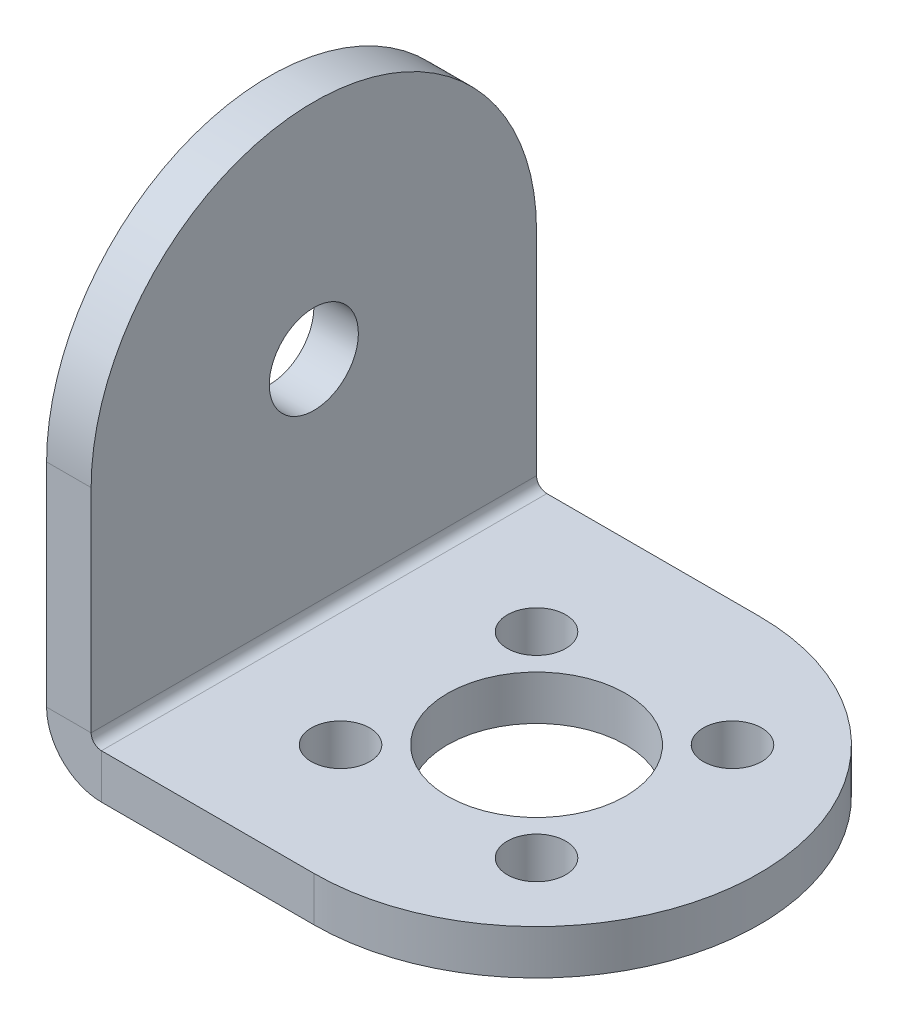
ISO-10303-21;
HEADER;
FILE_DESCRIPTION(('STEP AP214'),'2;1');
FILE_NAME('part.step','',(''),(''),'','','');
FILE_SCHEMA(('AUTOMOTIVE_DESIGN { 1 0 10303 214 1 1 1 1 }'));
ENDSEC;
DATA;
#1=APPLICATION_CONTEXT('core data for automotive mechanical design processes');
#2=APPLICATION_PROTOCOL_DEFINITION('international standard','automotive_design',2000,#1);
#3=PRODUCT_CONTEXT('',#1,'mechanical');
#4=PRODUCT('Part','Part','',(#3));
#5=PRODUCT_RELATED_PRODUCT_CATEGORY('part','',(#4));
#6=PRODUCT_DEFINITION_FORMATION('','',#4);
#7=PRODUCT_DEFINITION_CONTEXT('part definition',#1,'design');
#8=PRODUCT_DEFINITION('design','',#6,#7);
#9=PRODUCT_DEFINITION_SHAPE('','',#8);
#10=(LENGTH_UNIT() NAMED_UNIT(*) SI_UNIT(.MILLI.,.METRE.));
#11=(NAMED_UNIT(*) PLANE_ANGLE_UNIT() SI_UNIT($,.RADIAN.));
#12=(NAMED_UNIT(*) SI_UNIT($,.STERADIAN.) SOLID_ANGLE_UNIT());
#13=UNCERTAINTY_MEASURE_WITH_UNIT(LENGTH_MEASURE(1.E-05),#10,'distance_accuracy_value','');
#14=(GEOMETRIC_REPRESENTATION_CONTEXT(3) GLOBAL_UNCERTAINTY_ASSIGNED_CONTEXT((#13)) GLOBAL_UNIT_ASSIGNED_CONTEXT((#10,
#11,#12)) REPRESENTATION_CONTEXT('',''));
#15=CARTESIAN_POINT('',(0.,0.,0.));
#16=DIRECTION('',(0.,0.,1.));
#17=DIRECTION('',(1.,0.,0.));
#18=AXIS2_PLACEMENT_3D('',#15,#16,#17);
#19=CARTESIAN_POINT('',(15.875,0.,0.));
#20=DIRECTION('',(0.,-1.,0.));
#21=DIRECTION('',(0.,0.,-1.));
#22=AXIS2_PLACEMENT_3D('',#19,#20,#21);
#23=CYLINDRICAL_SURFACE('',#22,15.875);
#24=DIRECTION('',(0.,-1.,0.));
#25=VECTOR('',#24,1.);
#26=CARTESIAN_POINT('',(15.875,0.7366,-15.875));
#27=LINE('',#26,#25);
#28=CARTESIAN_POINT('',(15.875,0.,-15.875));
#29=VERTEX_POINT('',#28);
#30=CARTESIAN_POINT('',(15.875,-3.175,-15.875));
#31=VERTEX_POINT('',#30);
#32=EDGE_CURVE('E184',#29,#31,#27,.T.);
#33=ORIENTED_EDGE('',*,*,#32,.F.);
#34=CARTESIAN_POINT('',(15.875,0.,0.));
#35=DIRECTION('',(0.,1.,0.));
#36=DIRECTION('',(0.,0.,1.));
#37=AXIS2_PLACEMENT_3D('',#34,#35,#36);
#38=CIRCLE('',#37,15.875);
#39=CARTESIAN_POINT('',(15.875,0.,15.875));
#40=VERTEX_POINT('',#39);
#41=EDGE_CURVE('E49',#40,#29,#38,.T.);
#42=ORIENTED_EDGE('',*,*,#41,.F.);
#43=DIRECTION('',(0.,-1.,0.));
#44=VECTOR('',#43,1.);
#45=CARTESIAN_POINT('',(15.875,0.736600000000001,15.875));
#46=LINE('',#45,#44);
#47=CARTESIAN_POINT('',(15.875,-3.175,15.875));
#48=VERTEX_POINT('',#47);
#49=EDGE_CURVE('E135',#48,#40,#46,.F.);
#50=ORIENTED_EDGE('',*,*,#49,.F.);
#51=CARTESIAN_POINT('',(15.875,-3.175,0.));
#52=DIRECTION('',(0.,1.,0.));
#53=DIRECTION('',(0.,0.,1.));
#54=AXIS2_PLACEMENT_3D('',#51,#52,#53);
#55=CIRCLE('',#54,15.875);
#56=EDGE_CURVE('E11',#31,#48,#55,.F.);
#57=ORIENTED_EDGE('',*,*,#56,.F.);
#58=EDGE_LOOP('',(#33,#42,#50,#57));
#59=FACE_BOUND('',#58,.T.);
#60=ADVANCED_FACE('F41',(#59),#23,.T.);
#61=CARTESIAN_POINT('',(0.,15.875,0.));
#62=DIRECTION('',(1.,0.,0.));
#63=DIRECTION('',(0.,0.,-1.));
#64=AXIS2_PLACEMENT_3D('',#61,#62,#63);
#65=CYLINDRICAL_SURFACE('',#64,15.875);
#66=DIRECTION('',(-1.,0.,0.));
#67=VECTOR('',#66,1.);
#68=CARTESIAN_POINT('',(0.,15.875,15.875));
#69=LINE('',#68,#67);
#70=CARTESIAN_POINT('',(0.,15.875,15.875));
#71=VERTEX_POINT('',#70);
#72=CARTESIAN_POINT('',(-3.175,15.875,15.875));
#73=VERTEX_POINT('',#72);
#74=EDGE_CURVE('E116',#71,#73,#69,.T.);
#75=ORIENTED_EDGE('',*,*,#74,.F.);
#76=CARTESIAN_POINT('',(0.,15.875,0.));
#77=DIRECTION('',(1.,0.,0.));
#78=DIRECTION('',(0.,1.,0.));
#79=AXIS2_PLACEMENT_3D('',#76,#77,#78);
#80=CIRCLE('',#79,15.875);
#81=CARTESIAN_POINT('',(0.,15.875,-15.875));
#82=VERTEX_POINT('',#81);
#83=EDGE_CURVE('E180',#82,#71,#80,.T.);
#84=ORIENTED_EDGE('',*,*,#83,.F.);
#85=DIRECTION('',(1.,0.,0.));
#86=VECTOR('',#85,1.);
#87=CARTESIAN_POINT('',(0.7366,15.875,-15.875));
#88=LINE('',#87,#86);
#89=CARTESIAN_POINT('',(-3.175,15.875,-15.875));
#90=VERTEX_POINT('',#89);
#91=EDGE_CURVE('E177',#90,#82,#88,.T.);
#92=ORIENTED_EDGE('',*,*,#91,.F.);
#93=CARTESIAN_POINT('',(-3.175,15.875,0.));
#94=DIRECTION('',(1.,0.,0.));
#95=DIRECTION('',(0.,1.,0.));
#96=AXIS2_PLACEMENT_3D('',#93,#94,#95);
#97=CIRCLE('',#96,15.875);
#98=EDGE_CURVE('E182',#73,#90,#97,.F.);
#99=ORIENTED_EDGE('',*,*,#98,.F.);
#100=EDGE_LOOP('',(#75,#84,#92,#99));
#101=FACE_BOUND('',#100,.T.);
#102=ADVANCED_FACE('F272',(#101),#65,.T.);
#103=CARTESIAN_POINT('',(0.7366,0.,15.875));
#104=DIRECTION('',(0.,0.,1.));
#105=DIRECTION('',(1.,0.,0.));
#106=AXIS2_PLACEMENT_3D('',#103,#104,#105);
#107=PLANE('',#106);
#108=DIRECTION('',(0.,-1.,0.));
#109=VECTOR('',#108,1.);
#110=CARTESIAN_POINT('',(0.7366,0.,15.875));
#111=LINE('',#110,#109);
#112=CARTESIAN_POINT('',(0.7366,0.,15.875));
#113=VERTEX_POINT('',#112);
#114=CARTESIAN_POINT('',(0.7366,-3.175,15.875));
#115=VERTEX_POINT('',#114);
#116=EDGE_CURVE('E104',#113,#115,#111,.T.);
#117=ORIENTED_EDGE('',*,*,#116,.F.);
#118=CARTESIAN_POINT('',(0.7366,0.7366,15.875));
#119=DIRECTION('',(0.,0.,-1.));
#120=DIRECTION('',(-1.,0.,0.));
#121=AXIS2_PLACEMENT_3D('',#118,#119,#120);
#122=CIRCLE('',#121,0.7366);
#123=CARTESIAN_POINT('',(0.,0.7366,15.875));
#124=VERTEX_POINT('',#123);
#125=EDGE_CURVE('E109',#124,#113,#122,.F.);
#126=ORIENTED_EDGE('',*,*,#125,.F.);
#127=DIRECTION('',(1.,0.,0.));
#128=VECTOR('',#127,1.);
#129=CARTESIAN_POINT('',(-3.175,0.736600000000001,15.875));
#130=LINE('',#129,#128);
#131=CARTESIAN_POINT('',(-3.175,0.736600000000001,15.875));
#132=VERTEX_POINT('',#131);
#133=EDGE_CURVE('E117',#132,#124,#130,.T.);
#134=ORIENTED_EDGE('',*,*,#133,.F.);
#135=CARTESIAN_POINT('',(0.7366,0.7366,15.875));
#136=DIRECTION('',(0.,0.,1.));
#137=DIRECTION('',(1.,0.,0.));
#138=AXIS2_PLACEMENT_3D('',#135,#136,#137);
#139=CIRCLE('',#138,3.9116);
#140=EDGE_CURVE('E111',#132,#115,#139,.T.);
#141=ORIENTED_EDGE('',*,*,#140,.T.);
#142=EDGE_LOOP('',(#117,#126,#134,#141));
#143=FACE_BOUND('',#142,.T.);
#144=ADVANCED_FACE('F106',(#143),#107,.T.);
#145=CARTESIAN_POINT('',(-3.175,0.736600000000001,15.875));
#146=DIRECTION('',(0.,0.,1.));
#147=DIRECTION('',(1.,0.,0.));
#148=AXIS2_PLACEMENT_3D('',#145,#146,#147);
#149=PLANE('',#148);
#150=DIRECTION('',(1.,0.,0.));
#151=VECTOR('',#150,1.);
#152=CARTESIAN_POINT('',(0.,-3.175,15.875));
#153=LINE('',#152,#151);
#154=EDGE_CURVE('E136',#115,#48,#153,.T.);
#155=ORIENTED_EDGE('',*,*,#154,.T.);
#156=ORIENTED_EDGE('',*,*,#49,.T.);
#157=DIRECTION('',(1.,0.,0.));
#158=VECTOR('',#157,1.);
#159=CARTESIAN_POINT('',(0.,0.,15.875));
#160=LINE('',#159,#158);
#161=EDGE_CURVE('E125',#113,#40,#160,.T.);
#162=ORIENTED_EDGE('',*,*,#161,.F.);
#163=ORIENTED_EDGE('',*,*,#116,.T.);
#164=EDGE_LOOP('',(#155,#156,#162,#163));
#165=FACE_BOUND('',#164,.T.);
#166=ADVANCED_FACE('F134',(#165),#149,.T.);
#167=CARTESIAN_POINT('',(0.,0.7366,-15.875));
#168=DIRECTION('',(0.,0.,-1.));
#169=DIRECTION('',(-1.,0.,0.));
#170=AXIS2_PLACEMENT_3D('',#167,#168,#169);
#171=PLANE('',#170);
#172=DIRECTION('',(-1.,0.,0.));
#173=VECTOR('',#172,1.);
#174=CARTESIAN_POINT('',(0.,0.7366,-15.875));
#175=LINE('',#174,#173);
#176=CARTESIAN_POINT('',(0.,0.7366,-15.875));
#177=VERTEX_POINT('',#176);
#178=CARTESIAN_POINT('',(-3.175,0.736600000000001,-15.875));
#179=VERTEX_POINT('',#178);
#180=EDGE_CURVE('E170',#177,#179,#175,.T.);
#181=ORIENTED_EDGE('',*,*,#180,.F.);
#182=CARTESIAN_POINT('',(0.7366,0.7366,-15.875));
#183=DIRECTION('',(0.,0.,-1.));
#184=DIRECTION('',(-1.,0.,0.));
#185=AXIS2_PLACEMENT_3D('',#182,#183,#184);
#186=CIRCLE('',#185,0.7366);
#187=CARTESIAN_POINT('',(0.7366,0.,-15.875));
#188=VERTEX_POINT('',#187);
#189=EDGE_CURVE('E154',#177,#188,#186,.F.);
#190=ORIENTED_EDGE('',*,*,#189,.T.);
#191=DIRECTION('',(0.,1.,0.));
#192=VECTOR('',#191,1.);
#193=CARTESIAN_POINT('',(0.7366,-3.175,-15.875));
#194=LINE('',#193,#192);
#195=CARTESIAN_POINT('',(0.7366,-3.175,-15.875));
#196=VERTEX_POINT('',#195);
#197=EDGE_CURVE('E131',#196,#188,#194,.T.);
#198=ORIENTED_EDGE('',*,*,#197,.F.);
#199=CARTESIAN_POINT('',(0.7366,0.7366,-15.875));
#200=DIRECTION('',(0.,0.,1.));
#201=DIRECTION('',(1.,0.,0.));
#202=AXIS2_PLACEMENT_3D('',#199,#200,#201);
#203=CIRCLE('',#202,3.9116);
#204=EDGE_CURVE('E160',#179,#196,#203,.T.);
#205=ORIENTED_EDGE('',*,*,#204,.F.);
#206=EDGE_LOOP('',(#181,#190,#198,#205));
#207=FACE_BOUND('',#206,.T.);
#208=ADVANCED_FACE('F193',(#207),#171,.T.);
#209=CARTESIAN_POINT('',(0.7366,-3.175,-15.875));
#210=DIRECTION('',(0.,0.,-1.));
#211=DIRECTION('',(-1.,0.,0.));
#212=AXIS2_PLACEMENT_3D('',#209,#210,#211);
#213=PLANE('',#212);
#214=DIRECTION('',(0.,-1.,0.));
#215=VECTOR('',#214,1.);
#216=CARTESIAN_POINT('',(-3.175,31.75,-15.875));
#217=LINE('',#216,#215);
#218=EDGE_CURVE('E158',#90,#179,#217,.T.);
#219=ORIENTED_EDGE('',*,*,#218,.F.);
#220=ORIENTED_EDGE('',*,*,#91,.T.);
#221=DIRECTION('',(0.,-1.,0.));
#222=VECTOR('',#221,1.);
#223=CARTESIAN_POINT('',(0.,31.75,-15.875));
#224=LINE('',#223,#222);
#225=EDGE_CURVE('E156',#82,#177,#224,.T.);
#226=ORIENTED_EDGE('',*,*,#225,.T.);
#227=ORIENTED_EDGE('',*,*,#180,.T.);
#228=EDGE_LOOP('',(#219,#220,#226,#227));
#229=FACE_BOUND('',#228,.T.);
#230=ADVANCED_FACE('F290',(#229),#213,.T.);
#231=CARTESIAN_POINT('',(0.,-3.175,15.875));
#232=DIRECTION('',(0.,1.,0.));
#233=DIRECTION('',(0.,0.,1.));
#234=AXIS2_PLACEMENT_3D('',#231,#232,#233);
#235=PLANE('',#234);
#236=CARTESIAN_POINT('',(22.8600000000022,-3.175,-6.98499999999986));
#237=DIRECTION('',(0.,1.,0.));
#238=DIRECTION('',(0.,0.,1.));
#239=AXIS2_PLACEMENT_3D('',#236,#237,#238);
#240=CIRCLE('',#239,2.08279999999637);
#241=CARTESIAN_POINT('',(22.8600000000022,-3.175,-4.90220000000349));
#242=VERTEX_POINT('',#241);
#243=EDGE_CURVE('E214',#242,#242,#240,.T.);
#244=ORIENTED_EDGE('',*,*,#243,.T.);
#245=EDGE_LOOP('',(#244));
#246=FACE_BOUND('',#245,.T.);
#247=CARTESIAN_POINT('',(8.89000000000219,-3.175,-6.98499999999986));
#248=DIRECTION('',(0.,1.,0.));
#249=DIRECTION('',(0.,0.,1.));
#250=AXIS2_PLACEMENT_3D('',#247,#248,#249);
#251=CIRCLE('',#250,2.08279999991159);
#252=CARTESIAN_POINT('',(8.89000000000219,-3.175,-4.90220000008827));
#253=VERTEX_POINT('',#252);
#254=EDGE_CURVE('E226',#253,#253,#251,.T.);
#255=ORIENTED_EDGE('',*,*,#254,.T.);
#256=EDGE_LOOP('',(#255));
#257=FACE_BOUND('',#256,.T.);
#258=CARTESIAN_POINT('',(8.89000000000219,-3.175,6.98500000000015));
#259=DIRECTION('',(0.,1.,0.));
#260=DIRECTION('',(0.,0.,1.));
#261=AXIS2_PLACEMENT_3D('',#258,#259,#260);
#262=CIRCLE('',#261,2.08279999991158);
#263=CARTESIAN_POINT('',(8.89000000000219,-3.175,9.06779999991173));
#264=VERTEX_POINT('',#263);
#265=EDGE_CURVE('E220',#264,#264,#262,.T.);
#266=ORIENTED_EDGE('',*,*,#265,.T.);
#267=EDGE_LOOP('',(#266));
#268=FACE_BOUND('',#267,.T.);
#269=CARTESIAN_POINT('',(22.8600000000022,-3.175,6.98500000000014));
#270=DIRECTION('',(0.,1.,0.));
#271=DIRECTION('',(0.,0.,1.));
#272=AXIS2_PLACEMENT_3D('',#269,#270,#271);
#273=CIRCLE('',#272,2.08279999999637);
#274=CARTESIAN_POINT('',(22.8600000000022,-3.175,9.06779999999651));
#275=VERTEX_POINT('',#274);
#276=EDGE_CURVE('E208',#275,#275,#273,.T.);
#277=ORIENTED_EDGE('',*,*,#276,.T.);
#278=EDGE_LOOP('',(#277));
#279=FACE_BOUND('',#278,.T.);
#280=CARTESIAN_POINT('',(15.875,-3.175,0.));
#281=DIRECTION('',(0.,1.,0.));
#282=DIRECTION('',(0.,0.,1.));
#283=AXIS2_PLACEMENT_3D('',#280,#281,#282);
#284=CIRCLE('',#283,6.35);
#285=CARTESIAN_POINT('',(15.875,-3.175,6.35));
#286=VERTEX_POINT('',#285);
#287=EDGE_CURVE('E202',#286,#286,#284,.T.);
#288=ORIENTED_EDGE('',*,*,#287,.T.);
#289=EDGE_LOOP('',(#288));
#290=FACE_BOUND('',#289,.T.);
#291=DIRECTION('',(1.,0.,0.));
#292=VECTOR('',#291,1.);
#293=CARTESIAN_POINT('',(0.,-3.175,-15.875));
#294=LINE('',#293,#292);
#295=EDGE_CURVE('E150',#196,#31,#294,.T.);
#296=ORIENTED_EDGE('',*,*,#295,.T.);
#297=ORIENTED_EDGE('',*,*,#56,.T.);
#298=ORIENTED_EDGE('',*,*,#154,.F.);
#299=DIRECTION('',(0.,0.,-1.));
#300=VECTOR('',#299,1.);
#301=CARTESIAN_POINT('',(0.7366,-3.175,15.875));
#302=LINE('',#301,#300);
#303=EDGE_CURVE('E149',#115,#196,#302,.T.);
#304=ORIENTED_EDGE('',*,*,#303,.T.);
#305=EDGE_LOOP('',(#296,#297,#298,#304));
#306=FACE_BOUND('',#305,.T.);
#307=ADVANCED_FACE('F197',(#246,#257,#268,#279,#290,#306),#235,.F.);
#308=CARTESIAN_POINT('',(0.,0.,15.875));
#309=DIRECTION('',(0.,1.,0.));
#310=DIRECTION('',(0.,0.,1.));
#311=AXIS2_PLACEMENT_3D('',#308,#309,#310);
#312=PLANE('',#311);
#313=CARTESIAN_POINT('',(22.8600000000022,0.,-6.98499999999986));
#314=DIRECTION('',(0.,1.,0.));
#315=DIRECTION('',(0.,0.,1.));
#316=AXIS2_PLACEMENT_3D('',#313,#314,#315);
#317=CIRCLE('',#316,2.08279999999637);
#318=CARTESIAN_POINT('',(22.8600000000022,0.,-4.90220000000349));
#319=VERTEX_POINT('',#318);
#320=EDGE_CURVE('E229',#319,#319,#317,.T.);
#321=ORIENTED_EDGE('',*,*,#320,.F.);
#322=EDGE_LOOP('',(#321));
#323=FACE_BOUND('',#322,.T.);
#324=CARTESIAN_POINT('',(8.89000000000219,0.,-6.98499999999986));
#325=DIRECTION('',(0.,1.,0.));
#326=DIRECTION('',(0.,0.,1.));
#327=AXIS2_PLACEMENT_3D('',#324,#325,#326);
#328=CIRCLE('',#327,2.08279999991159);
#329=CARTESIAN_POINT('',(8.89000000000219,0.,-4.90220000008827));
#330=VERTEX_POINT('',#329);
#331=EDGE_CURVE('E223',#330,#330,#328,.T.);
#332=ORIENTED_EDGE('',*,*,#331,.F.);
#333=EDGE_LOOP('',(#332));
#334=FACE_BOUND('',#333,.T.);
#335=CARTESIAN_POINT('',(8.89000000000219,0.,6.98500000000015));
#336=DIRECTION('',(0.,1.,0.));
#337=DIRECTION('',(0.,0.,1.));
#338=AXIS2_PLACEMENT_3D('',#335,#336,#337);
#339=CIRCLE('',#338,2.08279999991158);
#340=CARTESIAN_POINT('',(8.89000000000219,0.,9.06779999991173));
#341=VERTEX_POINT('',#340);
#342=EDGE_CURVE('E217',#341,#341,#339,.T.);
#343=ORIENTED_EDGE('',*,*,#342,.F.);
#344=EDGE_LOOP('',(#343));
#345=FACE_BOUND('',#344,.T.);
#346=CARTESIAN_POINT('',(22.8600000000022,0.,6.98500000000014));
#347=DIRECTION('',(0.,1.,0.));
#348=DIRECTION('',(0.,0.,1.));
#349=AXIS2_PLACEMENT_3D('',#346,#347,#348);
#350=CIRCLE('',#349,2.08279999999637);
#351=CARTESIAN_POINT('',(22.8600000000022,0.,9.06779999999651));
#352=VERTEX_POINT('',#351);
#353=EDGE_CURVE('E211',#352,#352,#350,.T.);
#354=ORIENTED_EDGE('',*,*,#353,.F.);
#355=EDGE_LOOP('',(#354));
#356=FACE_BOUND('',#355,.T.);
#357=CARTESIAN_POINT('',(15.875,0.,0.));
#358=DIRECTION('',(0.,1.,0.));
#359=DIRECTION('',(0.,0.,1.));
#360=AXIS2_PLACEMENT_3D('',#357,#358,#359);
#361=CIRCLE('',#360,6.35);
#362=CARTESIAN_POINT('',(15.875,0.,6.35));
#363=VERTEX_POINT('',#362);
#364=EDGE_CURVE('E205',#363,#363,#361,.T.);
#365=ORIENTED_EDGE('',*,*,#364,.F.);
#366=EDGE_LOOP('',(#365));
#367=FACE_BOUND('',#366,.T.);
#368=ORIENTED_EDGE('',*,*,#161,.T.);
#369=ORIENTED_EDGE('',*,*,#41,.T.);
#370=DIRECTION('',(1.,0.,0.));
#371=VECTOR('',#370,1.);
#372=CARTESIAN_POINT('',(0.,0.,-15.875));
#373=LINE('',#372,#371);
#374=EDGE_CURVE('E127',#188,#29,#373,.T.);
#375=ORIENTED_EDGE('',*,*,#374,.F.);
#376=DIRECTION('',(0.,0.,-1.));
#377=VECTOR('',#376,1.);
#378=CARTESIAN_POINT('',(0.7366,0.,15.875));
#379=LINE('',#378,#377);
#380=EDGE_CURVE('E123',#113,#188,#379,.T.);
#381=ORIENTED_EDGE('',*,*,#380,.F.);
#382=EDGE_LOOP('',(#368,#369,#375,#381));
#383=FACE_BOUND('',#382,.T.);
#384=ADVANCED_FACE('F124',(#323,#334,#345,#356,#367,#383),#312,.T.);
#385=CARTESIAN_POINT('',(0.7366,0.7366,15.875));
#386=DIRECTION('',(0.,0.,-1.));
#387=DIRECTION('',(-1.,0.,0.));
#388=AXIS2_PLACEMENT_3D('',#385,#386,#387);
#389=CYLINDRICAL_SURFACE('',#388,0.7366);
#390=ORIENTED_EDGE('',*,*,#189,.F.);
#391=DIRECTION('',(0.,0.,-1.));
#392=VECTOR('',#391,1.);
#393=CARTESIAN_POINT('',(0.,0.7366,15.875));
#394=LINE('',#393,#392);
#395=EDGE_CURVE('E132',#124,#177,#394,.T.);
#396=ORIENTED_EDGE('',*,*,#395,.F.);
#397=ORIENTED_EDGE('',*,*,#125,.T.);
#398=ORIENTED_EDGE('',*,*,#380,.T.);
#399=EDGE_LOOP('',(#390,#396,#397,#398));
#400=FACE_BOUND('',#399,.T.);
#401=ADVANCED_FACE('F139',(#400),#389,.F.);
#402=CARTESIAN_POINT('',(0.,31.75,15.875));
#403=DIRECTION('',(1.,0.,0.));
#404=DIRECTION('',(0.,1.,0.));
#405=AXIS2_PLACEMENT_3D('',#402,#403,#404);
#406=PLANE('',#405);
#407=CARTESIAN_POINT('',(0.,15.875,0.));
#408=DIRECTION('',(1.,0.,0.));
#409=DIRECTION('',(0.,1.,0.));
#410=AXIS2_PLACEMENT_3D('',#407,#408,#409);
#411=CIRCLE('',#410,3.175);
#412=CARTESIAN_POINT('',(0.,19.05,0.));
#413=VERTEX_POINT('',#412);
#414=EDGE_CURVE('E199',#413,#413,#411,.T.);
#415=ORIENTED_EDGE('',*,*,#414,.F.);
#416=EDGE_LOOP('',(#415));
#417=FACE_BOUND('',#416,.T.);
#418=ORIENTED_EDGE('',*,*,#225,.F.);
#419=ORIENTED_EDGE('',*,*,#83,.T.);
#420=DIRECTION('',(0.,-1.,0.));
#421=VECTOR('',#420,1.);
#422=CARTESIAN_POINT('',(0.,31.75,15.875));
#423=LINE('',#422,#421);
#424=EDGE_CURVE('E141',#71,#124,#423,.T.);
#425=ORIENTED_EDGE('',*,*,#424,.T.);
#426=ORIENTED_EDGE('',*,*,#395,.T.);
#427=EDGE_LOOP('',(#418,#419,#425,#426));
#428=FACE_BOUND('',#427,.T.);
#429=ADVANCED_FACE('F298',(#417,#428),#406,.T.);
#430=CARTESIAN_POINT('',(-3.175,31.75,15.875));
#431=DIRECTION('',(1.,0.,0.));
#432=DIRECTION('',(0.,1.,0.));
#433=AXIS2_PLACEMENT_3D('',#430,#431,#432);
#434=PLANE('',#433);
#435=CARTESIAN_POINT('',(-3.175,15.875,0.));
#436=DIRECTION('',(1.,0.,0.));
#437=DIRECTION('',(0.,1.,0.));
#438=AXIS2_PLACEMENT_3D('',#435,#436,#437);
#439=CIRCLE('',#438,3.175);
#440=CARTESIAN_POINT('',(-3.175,19.05,0.));
#441=VERTEX_POINT('',#440);
#442=EDGE_CURVE('E152',#441,#441,#439,.T.);
#443=ORIENTED_EDGE('',*,*,#442,.T.);
#444=EDGE_LOOP('',(#443));
#445=FACE_BOUND('',#444,.T.);
#446=DIRECTION('',(0.,-1.,0.));
#447=VECTOR('',#446,1.);
#448=CARTESIAN_POINT('',(-3.175,31.75,15.875));
#449=LINE('',#448,#447);
#450=EDGE_CURVE('E143',#73,#132,#449,.T.);
#451=ORIENTED_EDGE('',*,*,#450,.F.);
#452=ORIENTED_EDGE('',*,*,#98,.T.);
#453=ORIENTED_EDGE('',*,*,#218,.T.);
#454=DIRECTION('',(0.,0.,-1.));
#455=VECTOR('',#454,1.);
#456=CARTESIAN_POINT('',(-3.175,0.736600000000001,15.875));
#457=LINE('',#456,#455);
#458=EDGE_CURVE('E165',#132,#179,#457,.T.);
#459=ORIENTED_EDGE('',*,*,#458,.F.);
#460=EDGE_LOOP('',(#451,#452,#453,#459));
#461=FACE_BOUND('',#460,.T.);
#462=ADVANCED_FACE('F301',(#445,#461),#434,.F.);
#463=CARTESIAN_POINT('',(0.7366,0.7366,15.875));
#464=DIRECTION('',(0.,0.,-1.));
#465=DIRECTION('',(-1.,0.,0.));
#466=AXIS2_PLACEMENT_3D('',#463,#464,#465);
#467=CYLINDRICAL_SURFACE('',#466,3.9116);
#468=ORIENTED_EDGE('',*,*,#204,.T.);
#469=ORIENTED_EDGE('',*,*,#303,.F.);
#470=ORIENTED_EDGE('',*,*,#140,.F.);
#471=ORIENTED_EDGE('',*,*,#458,.T.);
#472=EDGE_LOOP('',(#468,#469,#470,#471));
#473=FACE_BOUND('',#472,.T.);
#474=ADVANCED_FACE('F195',(#473),#467,.T.);
#475=CARTESIAN_POINT('',(0.7366,0.7366,15.875));
#476=DIRECTION('',(0.,0.,-1.));
#477=DIRECTION('',(-1.,0.,0.));
#478=AXIS2_PLACEMENT_3D('',#475,#476,#477);
#479=PLANE('',#478);
#480=ORIENTED_EDGE('',*,*,#424,.F.);
#481=ORIENTED_EDGE('',*,*,#74,.T.);
#482=ORIENTED_EDGE('',*,*,#450,.T.);
#483=ORIENTED_EDGE('',*,*,#133,.T.);
#484=EDGE_LOOP('',(#480,#481,#482,#483));
#485=FACE_BOUND('',#484,.T.);
#486=ADVANCED_FACE('F308',(#485),#479,.F.);
#487=CARTESIAN_POINT('',(0.7366,0.7366,-15.875));
#488=DIRECTION('',(0.,0.,-1.));
#489=DIRECTION('',(-1.,0.,0.));
#490=AXIS2_PLACEMENT_3D('',#487,#488,#489);
#491=PLANE('',#490);
#492=ORIENTED_EDGE('',*,*,#374,.T.);
#493=ORIENTED_EDGE('',*,*,#32,.T.);
#494=ORIENTED_EDGE('',*,*,#295,.F.);
#495=ORIENTED_EDGE('',*,*,#197,.T.);
#496=EDGE_LOOP('',(#492,#493,#494,#495));
#497=FACE_BOUND('',#496,.T.);
#498=ADVANCED_FACE('F189',(#497),#491,.T.);
#499=CARTESIAN_POINT('',(-3.175,15.875,0.));
#500=DIRECTION('',(1.,0.,0.));
#501=DIRECTION('',(0.,1.,0.));
#502=AXIS2_PLACEMENT_3D('',#499,#500,#501);
#503=CYLINDRICAL_SURFACE('',#502,3.175);
#504=ORIENTED_EDGE('',*,*,#442,.F.);
#505=EDGE_LOOP('',(#504));
#506=FACE_BOUND('',#505,.T.);
#507=ORIENTED_EDGE('',*,*,#414,.T.);
#508=EDGE_LOOP('',(#507));
#509=FACE_BOUND('',#508,.T.);
#510=ADVANCED_FACE('F258',(#506,#509),#503,.F.);
#511=CARTESIAN_POINT('',(15.875,-3.175,0.));
#512=DIRECTION('',(0.,1.,0.));
#513=DIRECTION('',(0.,0.,1.));
#514=AXIS2_PLACEMENT_3D('',#511,#512,#513);
#515=CYLINDRICAL_SURFACE('',#514,6.35);
#516=ORIENTED_EDGE('',*,*,#287,.F.);
#517=EDGE_LOOP('',(#516));
#518=FACE_BOUND('',#517,.T.);
#519=ORIENTED_EDGE('',*,*,#364,.T.);
#520=EDGE_LOOP('',(#519));
#521=FACE_BOUND('',#520,.T.);
#522=ADVANCED_FACE('F255',(#518,#521),#515,.F.);
#523=CARTESIAN_POINT('',(22.8600000000022,-3.175,6.98500000000014));
#524=DIRECTION('',(0.,1.,0.));
#525=DIRECTION('',(0.,0.,1.));
#526=AXIS2_PLACEMENT_3D('',#523,#524,#525);
#527=CYLINDRICAL_SURFACE('',#526,2.08279999999637);
#528=ORIENTED_EDGE('',*,*,#276,.F.);
#529=EDGE_LOOP('',(#528));
#530=FACE_BOUND('',#529,.T.);
#531=ORIENTED_EDGE('',*,*,#353,.T.);
#532=EDGE_LOOP('',(#531));
#533=FACE_BOUND('',#532,.T.);
#534=ADVANCED_FACE('F257',(#530,#533),#527,.F.);
#535=CARTESIAN_POINT('',(8.89000000000219,-3.175,6.98500000000015));
#536=DIRECTION('',(0.,1.,0.));
#537=DIRECTION('',(0.,0.,1.));
#538=AXIS2_PLACEMENT_3D('',#535,#536,#537);
#539=CYLINDRICAL_SURFACE('',#538,2.08279999991158);
#540=ORIENTED_EDGE('',*,*,#265,.F.);
#541=EDGE_LOOP('',(#540));
#542=FACE_BOUND('',#541,.T.);
#543=ORIENTED_EDGE('',*,*,#342,.T.);
#544=EDGE_LOOP('',(#543));
#545=FACE_BOUND('',#544,.T.);
#546=ADVANCED_FACE('F265',(#542,#545),#539,.F.);
#547=CARTESIAN_POINT('',(8.89000000000219,-3.175,-6.98499999999986));
#548=DIRECTION('',(0.,1.,0.));
#549=DIRECTION('',(0.,0.,1.));
#550=AXIS2_PLACEMENT_3D('',#547,#548,#549);
#551=CYLINDRICAL_SURFACE('',#550,2.08279999991159);
#552=ORIENTED_EDGE('',*,*,#254,.F.);
#553=EDGE_LOOP('',(#552));
#554=FACE_BOUND('',#553,.T.);
#555=ORIENTED_EDGE('',*,*,#331,.T.);
#556=EDGE_LOOP('',(#555));
#557=FACE_BOUND('',#556,.T.);
#558=ADVANCED_FACE('F240',(#554,#557),#551,.F.);
#559=CARTESIAN_POINT('',(22.8600000000022,-3.175,-6.98499999999986));
#560=DIRECTION('',(0.,1.,0.));
#561=DIRECTION('',(0.,0.,1.));
#562=AXIS2_PLACEMENT_3D('',#559,#560,#561);
#563=CYLINDRICAL_SURFACE('',#562,2.08279999999637);
#564=ORIENTED_EDGE('',*,*,#243,.F.);
#565=EDGE_LOOP('',(#564));
#566=FACE_BOUND('',#565,.T.);
#567=ORIENTED_EDGE('',*,*,#320,.T.);
#568=EDGE_LOOP('',(#567));
#569=FACE_BOUND('',#568,.T.);
#570=ADVANCED_FACE('F237',(#566,#569),#563,.F.);
#571=CLOSED_SHELL('',(#60,#102,#144,#166,#208,#230,#307,#384,#401,#429,#462,#474,#486,#498,#510,
#522,#534,#546,#558,#570));
#572=MANIFOLD_SOLID_BREP('B2',#571);
#573=ADVANCED_BREP_SHAPE_REPRESENTATION('',(#18,#572),#14);
#574=SHAPE_DEFINITION_REPRESENTATION(#9,#573);
ENDSEC;
END-ISO-10303-21;
